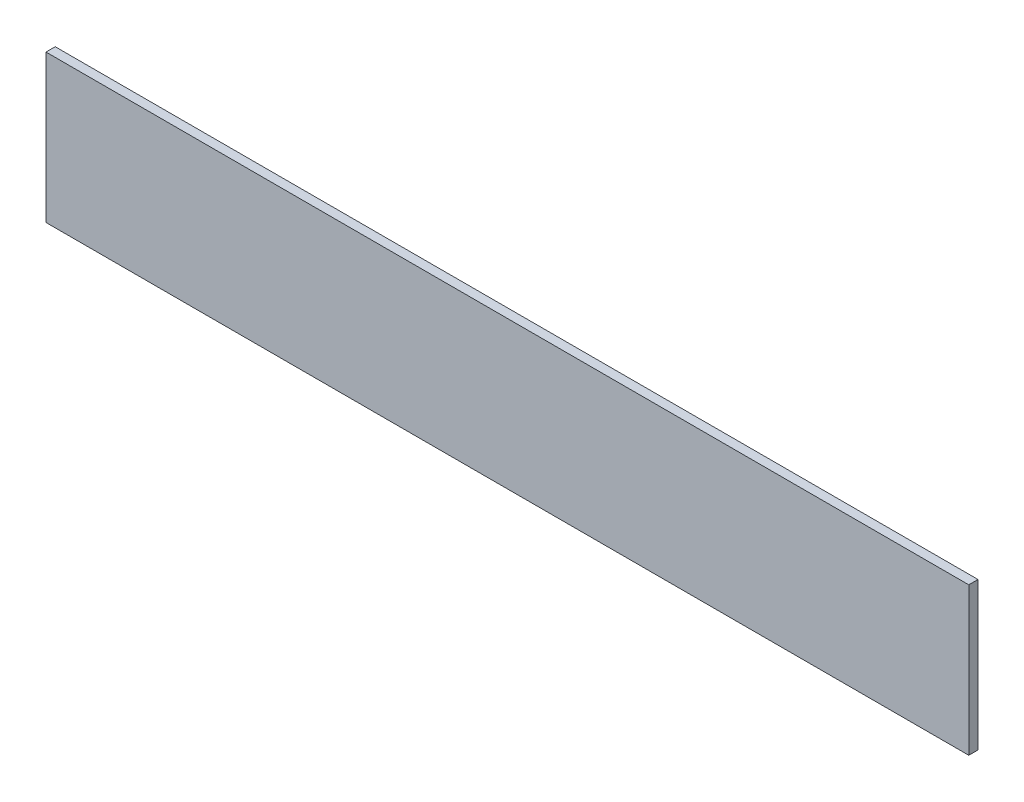
ISO-10303-21;
HEADER;
FILE_DESCRIPTION(('STEP AP214'),'2;1');
FILE_NAME('part.step','',(''),(''),'','','');
FILE_SCHEMA(('AUTOMOTIVE_DESIGN { 1 0 10303 214 1 1 1 1 }'));
ENDSEC;
DATA;
#1=APPLICATION_CONTEXT('core data for automotive mechanical design processes');
#2=APPLICATION_PROTOCOL_DEFINITION('international standard','automotive_design',2000,#1);
#3=PRODUCT_CONTEXT('',#1,'mechanical');
#4=PRODUCT('Part','Part','',(#3));
#5=PRODUCT_RELATED_PRODUCT_CATEGORY('part','',(#4));
#6=PRODUCT_DEFINITION_FORMATION('','',#4);
#7=PRODUCT_DEFINITION_CONTEXT('part definition',#1,'design');
#8=PRODUCT_DEFINITION('design','',#6,#7);
#9=PRODUCT_DEFINITION_SHAPE('','',#8);
#10=(LENGTH_UNIT() NAMED_UNIT(*) SI_UNIT(.MILLI.,.METRE.));
#11=(NAMED_UNIT(*) PLANE_ANGLE_UNIT() SI_UNIT($,.RADIAN.));
#12=(NAMED_UNIT(*) SI_UNIT($,.STERADIAN.) SOLID_ANGLE_UNIT());
#13=UNCERTAINTY_MEASURE_WITH_UNIT(LENGTH_MEASURE(1.E-05),#10,'distance_accuracy_value','');
#14=(GEOMETRIC_REPRESENTATION_CONTEXT(3) GLOBAL_UNCERTAINTY_ASSIGNED_CONTEXT((#13)) GLOBAL_UNIT_ASSIGNED_CONTEXT((#10,
#11,#12)) REPRESENTATION_CONTEXT('',''));
#15=CARTESIAN_POINT('',(0.,0.,0.));
#16=DIRECTION('',(0.,0.,1.));
#17=DIRECTION('',(1.,0.,0.));
#18=AXIS2_PLACEMENT_3D('',#15,#16,#17);
#19=CARTESIAN_POINT('',(635.,-101.6,12.7));
#20=DIRECTION('',(-1.,0.,0.));
#21=DIRECTION('',(0.,0.,1.));
#22=AXIS2_PLACEMENT_3D('',#19,#20,#21);
#23=PLANE('',#22);
#24=DIRECTION('',(0.,1.,0.));
#25=VECTOR('',#24,1.);
#26=CARTESIAN_POINT('',(635.,-101.6,0.));
#27=LINE('',#26,#25);
#28=CARTESIAN_POINT('',(635.,-101.6,0.));
#29=VERTEX_POINT('',#28);
#30=CARTESIAN_POINT('',(635.,101.6,0.));
#31=VERTEX_POINT('',#30);
#32=EDGE_CURVE('E96',#29,#31,#27,.T.);
#33=ORIENTED_EDGE('',*,*,#32,.T.);
#34=DIRECTION('',(0.,0.,-1.));
#35=VECTOR('',#34,1.);
#36=CARTESIAN_POINT('',(635.,101.6,12.7));
#37=LINE('',#36,#35);
#38=CARTESIAN_POINT('',(635.,101.6,12.7));
#39=VERTEX_POINT('',#38);
#40=EDGE_CURVE('E11',#39,#31,#37,.T.);
#41=ORIENTED_EDGE('',*,*,#40,.F.);
#42=DIRECTION('',(0.,1.,0.));
#43=VECTOR('',#42,1.);
#44=CARTESIAN_POINT('',(635.,-101.6,12.7));
#45=LINE('',#44,#43);
#46=CARTESIAN_POINT('',(635.,-101.6,12.7));
#47=VERTEX_POINT('',#46);
#48=EDGE_CURVE('E84',#47,#39,#45,.T.);
#49=ORIENTED_EDGE('',*,*,#48,.F.);
#50=DIRECTION('',(0.,0.,-1.));
#51=VECTOR('',#50,1.);
#52=CARTESIAN_POINT('',(635.,-101.6,12.7));
#53=LINE('',#52,#51);
#54=EDGE_CURVE('E92',#47,#29,#53,.T.);
#55=ORIENTED_EDGE('',*,*,#54,.T.);
#56=EDGE_LOOP('',(#33,#41,#49,#55));
#57=FACE_BOUND('',#56,.T.);
#58=ADVANCED_FACE('F33',(#57),#23,.F.);
#59=CARTESIAN_POINT('',(-635.,101.6,12.7));
#60=DIRECTION('',(0.,-1.,0.));
#61=DIRECTION('',(0.,0.,-1.));
#62=AXIS2_PLACEMENT_3D('',#59,#60,#61);
#63=PLANE('',#62);
#64=DIRECTION('',(-1.,0.,0.));
#65=VECTOR('',#64,1.);
#66=CARTESIAN_POINT('',(-635.,101.6,0.));
#67=LINE('',#66,#65);
#68=CARTESIAN_POINT('',(-635.,101.6,0.));
#69=VERTEX_POINT('',#68);
#70=EDGE_CURVE('E88',#31,#69,#67,.T.);
#71=ORIENTED_EDGE('',*,*,#70,.T.);
#72=DIRECTION('',(0.,0.,-1.));
#73=VECTOR('',#72,1.);
#74=CARTESIAN_POINT('',(-635.,101.6,12.7));
#75=LINE('',#74,#73);
#76=CARTESIAN_POINT('',(-635.,101.6,12.7));
#77=VERTEX_POINT('',#76);
#78=EDGE_CURVE('E41',#77,#69,#75,.T.);
#79=ORIENTED_EDGE('',*,*,#78,.F.);
#80=DIRECTION('',(-1.,0.,0.));
#81=VECTOR('',#80,1.);
#82=CARTESIAN_POINT('',(-635.,101.6,12.7));
#83=LINE('',#82,#81);
#84=EDGE_CURVE('E79',#39,#77,#83,.T.);
#85=ORIENTED_EDGE('',*,*,#84,.F.);
#86=ORIENTED_EDGE('',*,*,#40,.T.);
#87=EDGE_LOOP('',(#71,#79,#85,#86));
#88=FACE_BOUND('',#87,.T.);
#89=ADVANCED_FACE('F87',(#88),#63,.F.);
#90=CARTESIAN_POINT('',(-635.,-101.6,12.7));
#91=DIRECTION('',(1.,0.,0.));
#92=DIRECTION('',(0.,0.,-1.));
#93=AXIS2_PLACEMENT_3D('',#90,#91,#92);
#94=PLANE('',#93);
#95=DIRECTION('',(0.,-1.,0.));
#96=VECTOR('',#95,1.);
#97=CARTESIAN_POINT('',(-635.,-101.6,0.));
#98=LINE('',#97,#96);
#99=CARTESIAN_POINT('',(-635.,-101.6,0.));
#100=VERTEX_POINT('',#99);
#101=EDGE_CURVE('E66',#69,#100,#98,.T.);
#102=ORIENTED_EDGE('',*,*,#101,.T.);
#103=DIRECTION('',(0.,0.,-1.));
#104=VECTOR('',#103,1.);
#105=CARTESIAN_POINT('',(-635.,-101.6,12.7));
#106=LINE('',#105,#104);
#107=CARTESIAN_POINT('',(-635.,-101.6,12.7));
#108=VERTEX_POINT('',#107);
#109=EDGE_CURVE('E89',#108,#100,#106,.T.);
#110=ORIENTED_EDGE('',*,*,#109,.F.);
#111=DIRECTION('',(0.,-1.,0.));
#112=VECTOR('',#111,1.);
#113=CARTESIAN_POINT('',(-635.,-101.6,12.7));
#114=LINE('',#113,#112);
#115=EDGE_CURVE('E82',#77,#108,#114,.T.);
#116=ORIENTED_EDGE('',*,*,#115,.F.);
#117=ORIENTED_EDGE('',*,*,#78,.T.);
#118=EDGE_LOOP('',(#102,#110,#116,#117));
#119=FACE_BOUND('',#118,.T.);
#120=ADVANCED_FACE('F90',(#119),#94,.F.);
#121=CARTESIAN_POINT('',(-635.,-101.6,12.7));
#122=DIRECTION('',(0.,1.,0.));
#123=DIRECTION('',(0.,0.,1.));
#124=AXIS2_PLACEMENT_3D('',#121,#122,#123);
#125=PLANE('',#124);
#126=DIRECTION('',(1.,0.,0.));
#127=VECTOR('',#126,1.);
#128=CARTESIAN_POINT('',(-635.,-101.6,0.));
#129=LINE('',#128,#127);
#130=EDGE_CURVE('E72',#100,#29,#129,.T.);
#131=ORIENTED_EDGE('',*,*,#130,.T.);
#132=ORIENTED_EDGE('',*,*,#54,.F.);
#133=DIRECTION('',(1.,0.,0.));
#134=VECTOR('',#133,1.);
#135=CARTESIAN_POINT('',(-635.,-101.6,12.7));
#136=LINE('',#135,#134);
#137=EDGE_CURVE('E49',#108,#47,#136,.T.);
#138=ORIENTED_EDGE('',*,*,#137,.F.);
#139=ORIENTED_EDGE('',*,*,#109,.T.);
#140=EDGE_LOOP('',(#131,#132,#138,#139));
#141=FACE_BOUND('',#140,.T.);
#142=ADVANCED_FACE('F103',(#141),#125,.F.);
#143=CARTESIAN_POINT('',(0.,0.,12.7));
#144=DIRECTION('',(0.,0.,-1.));
#145=DIRECTION('',(-1.,0.,0.));
#146=AXIS2_PLACEMENT_3D('',#143,#144,#145);
#147=PLANE('',#146);
#148=ORIENTED_EDGE('',*,*,#48,.T.);
#149=ORIENTED_EDGE('',*,*,#84,.T.);
#150=ORIENTED_EDGE('',*,*,#115,.T.);
#151=ORIENTED_EDGE('',*,*,#137,.T.);
#152=EDGE_LOOP('',(#148,#149,#150,#151));
#153=FACE_BOUND('',#152,.T.);
#154=ADVANCED_FACE('F80',(#153),#147,.F.);
#155=CARTESIAN_POINT('',(0.,0.,0.));
#156=DIRECTION('',(0.,0.,-1.));
#157=DIRECTION('',(-1.,0.,0.));
#158=AXIS2_PLACEMENT_3D('',#155,#156,#157);
#159=PLANE('',#158);
#160=ORIENTED_EDGE('',*,*,#32,.F.);
#161=ORIENTED_EDGE('',*,*,#130,.F.);
#162=ORIENTED_EDGE('',*,*,#101,.F.);
#163=ORIENTED_EDGE('',*,*,#70,.F.);
#164=EDGE_LOOP('',(#160,#161,#162,#163));
#165=FACE_BOUND('',#164,.T.);
#166=ADVANCED_FACE('F106',(#165),#159,.T.);
#167=CLOSED_SHELL('',(#58,#89,#120,#142,#154,#166));
#168=MANIFOLD_SOLID_BREP('B2',#167);
#169=ADVANCED_BREP_SHAPE_REPRESENTATION('',(#18,#168),#14);
#170=SHAPE_DEFINITION_REPRESENTATION(#9,#169);
ENDSEC;
END-ISO-10303-21;
